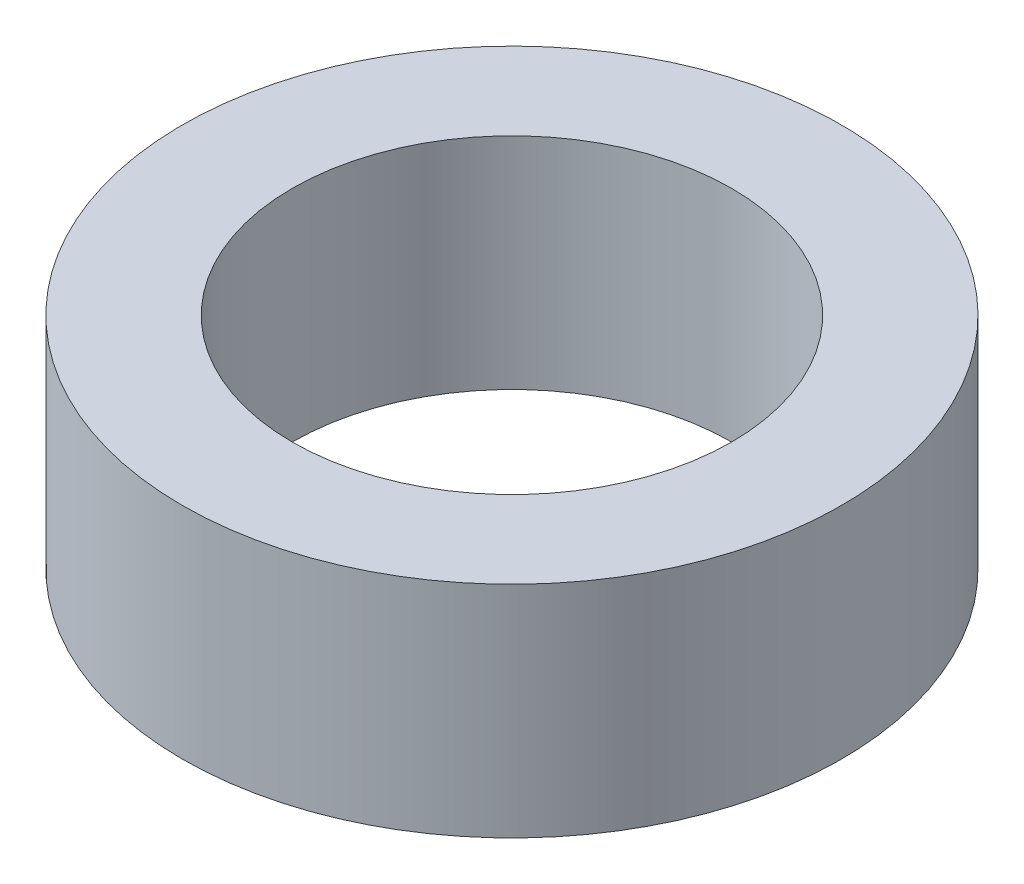
ISO-10303-21;
HEADER;
FILE_DESCRIPTION(('STEP AP214'),'2;1');
FILE_NAME('part.step','',(''),(''),'','','');
FILE_SCHEMA(('AUTOMOTIVE_DESIGN { 1 0 10303 214 1 1 1 1 }'));
ENDSEC;
DATA;
#1=APPLICATION_CONTEXT('core data for automotive mechanical design processes');
#2=APPLICATION_PROTOCOL_DEFINITION('international standard','automotive_design',2000,#1);
#3=PRODUCT_CONTEXT('',#1,'mechanical');
#4=PRODUCT('Part','Part','',(#3));
#5=PRODUCT_RELATED_PRODUCT_CATEGORY('part','',(#4));
#6=PRODUCT_DEFINITION_FORMATION('','',#4);
#7=PRODUCT_DEFINITION_CONTEXT('part definition',#1,'design');
#8=PRODUCT_DEFINITION('design','',#6,#7);
#9=PRODUCT_DEFINITION_SHAPE('','',#8);
#10=(LENGTH_UNIT() NAMED_UNIT(*) SI_UNIT(.MILLI.,.METRE.));
#11=(NAMED_UNIT(*) PLANE_ANGLE_UNIT() SI_UNIT($,.RADIAN.));
#12=(NAMED_UNIT(*) SI_UNIT($,.STERADIAN.) SOLID_ANGLE_UNIT());
#13=UNCERTAINTY_MEASURE_WITH_UNIT(LENGTH_MEASURE(1.E-05),#10,'distance_accuracy_value','');
#14=(GEOMETRIC_REPRESENTATION_CONTEXT(3) GLOBAL_UNCERTAINTY_ASSIGNED_CONTEXT((#13)) GLOBAL_UNIT_ASSIGNED_CONTEXT((#10,
#11,#12)) REPRESENTATION_CONTEXT('',''));
#15=CARTESIAN_POINT('',(0.,0.,0.));
#16=DIRECTION('',(0.,0.,1.));
#17=DIRECTION('',(1.,0.,0.));
#18=AXIS2_PLACEMENT_3D('',#15,#16,#17);
#19=CARTESIAN_POINT('',(0.,25.,0.));
#20=DIRECTION('',(0.,-1.,0.));
#21=DIRECTION('',(0.,0.,-1.));
#22=AXIS2_PLACEMENT_3D('',#19,#20,#21);
#23=CYLINDRICAL_SURFACE('',#22,37.5);
#24=CARTESIAN_POINT('',(0.,25.,0.));
#25=DIRECTION('',(0.,1.,0.));
#26=DIRECTION('',(0.,0.,1.));
#27=AXIS2_PLACEMENT_3D('',#24,#25,#26);
#28=CIRCLE('',#27,37.5);
#29=CARTESIAN_POINT('',(0.,25.,37.5));
#30=VERTEX_POINT('',#29);
#31=EDGE_CURVE('E10',#30,#30,#28,.T.);
#32=ORIENTED_EDGE('',*,*,#31,.F.);
#33=EDGE_LOOP('',(#32));
#34=FACE_BOUND('',#33,.T.);
#35=CARTESIAN_POINT('',(0.,0.,0.));
#36=DIRECTION('',(0.,1.,0.));
#37=DIRECTION('',(0.,0.,1.));
#38=AXIS2_PLACEMENT_3D('',#35,#36,#37);
#39=CIRCLE('',#38,37.5);
#40=CARTESIAN_POINT('',(0.,0.,37.5));
#41=VERTEX_POINT('',#40);
#42=EDGE_CURVE('E37',#41,#41,#39,.T.);
#43=ORIENTED_EDGE('',*,*,#42,.T.);
#44=EDGE_LOOP('',(#43));
#45=FACE_BOUND('',#44,.T.);
#46=ADVANCED_FACE('F40',(#34,#45),#23,.T.);
#47=CARTESIAN_POINT('',(0.,25.,0.));
#48=DIRECTION('',(0.,1.,0.));
#49=DIRECTION('',(0.,0.,1.));
#50=AXIS2_PLACEMENT_3D('',#47,#48,#49);
#51=PLANE('',#50);
#52=CARTESIAN_POINT('',(0.,25.,0.));
#53=DIRECTION('',(0.,1.,0.));
#54=DIRECTION('',(0.,0.,1.));
#55=AXIS2_PLACEMENT_3D('',#52,#53,#54);
#56=CIRCLE('',#55,25.);
#57=CARTESIAN_POINT('',(0.,25.,25.));
#58=VERTEX_POINT('',#57);
#59=EDGE_CURVE('E50',#58,#58,#56,.T.);
#60=ORIENTED_EDGE('',*,*,#59,.F.);
#61=EDGE_LOOP('',(#60));
#62=FACE_BOUND('',#61,.T.);
#63=ORIENTED_EDGE('',*,*,#31,.T.);
#64=EDGE_LOOP('',(#63));
#65=FACE_BOUND('',#64,.T.);
#66=ADVANCED_FACE('F59',(#62,#65),#51,.T.);
#67=CARTESIAN_POINT('',(0.,0.,0.));
#68=DIRECTION('',(0.,1.,0.));
#69=DIRECTION('',(0.,0.,1.));
#70=AXIS2_PLACEMENT_3D('',#67,#68,#69);
#71=PLANE('',#70);
#72=CARTESIAN_POINT('',(0.,0.,0.));
#73=DIRECTION('',(0.,1.,0.));
#74=DIRECTION('',(0.,0.,1.));
#75=AXIS2_PLACEMENT_3D('',#72,#73,#74);
#76=CIRCLE('',#75,25.);
#77=CARTESIAN_POINT('',(0.,0.,25.));
#78=VERTEX_POINT('',#77);
#79=EDGE_CURVE('E47',#78,#78,#76,.T.);
#80=ORIENTED_EDGE('',*,*,#79,.T.);
#81=EDGE_LOOP('',(#80));
#82=FACE_BOUND('',#81,.T.);
#83=ORIENTED_EDGE('',*,*,#42,.F.);
#84=EDGE_LOOP('',(#83));
#85=FACE_BOUND('',#84,.T.);
#86=ADVANCED_FACE('F58',(#82,#85),#71,.F.);
#87=CARTESIAN_POINT('',(0.,25.,0.));
#88=DIRECTION('',(0.,-1.,0.));
#89=DIRECTION('',(0.,0.,-1.));
#90=AXIS2_PLACEMENT_3D('',#87,#88,#89);
#91=CYLINDRICAL_SURFACE('',#90,25.);
#92=ORIENTED_EDGE('',*,*,#59,.T.);
#93=EDGE_LOOP('',(#92));
#94=FACE_BOUND('',#93,.T.);
#95=ORIENTED_EDGE('',*,*,#79,.F.);
#96=EDGE_LOOP('',(#95));
#97=FACE_BOUND('',#96,.T.);
#98=ADVANCED_FACE('F54',(#94,#97),#91,.F.);
#99=CLOSED_SHELL('',(#46,#66,#86,#98));
#100=MANIFOLD_SOLID_BREP('B2',#99);
#101=ADVANCED_BREP_SHAPE_REPRESENTATION('',(#18,#100),#14);
#102=SHAPE_DEFINITION_REPRESENTATION(#9,#101);
ENDSEC;
END-ISO-10303-21;
